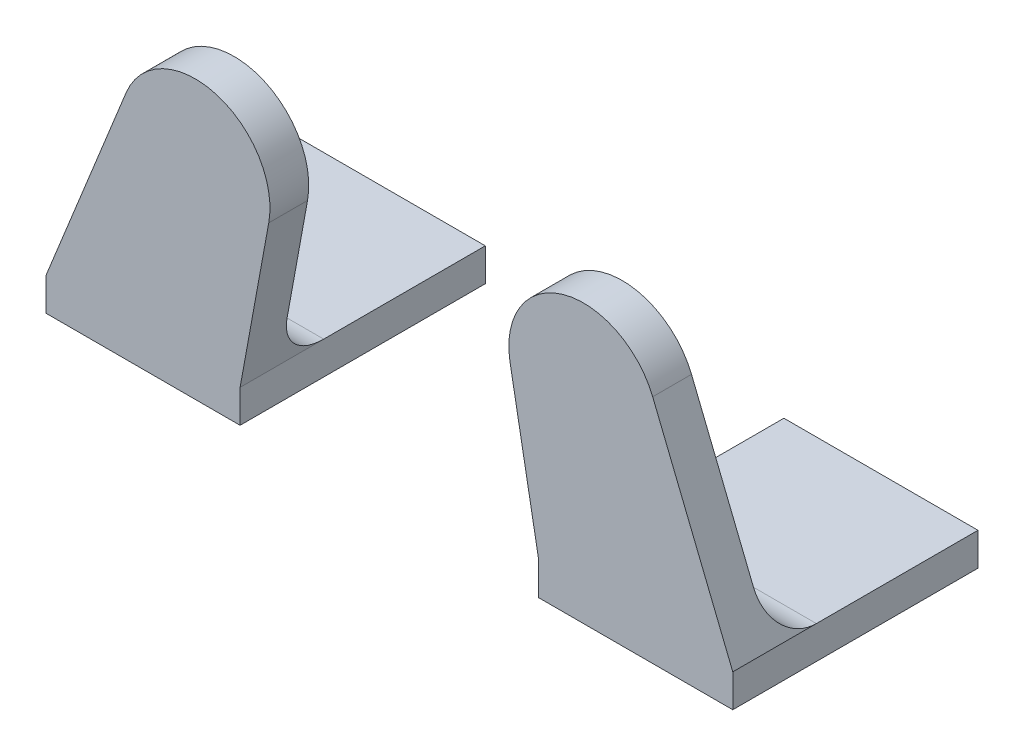
ISO-10303-21;
HEADER;
FILE_DESCRIPTION(('STEP AP214'),'2;1');
FILE_NAME('part.step','',(''),(''),'','','');
FILE_SCHEMA(('AUTOMOTIVE_DESIGN { 1 0 10303 214 1 1 1 1 }'));
ENDSEC;
DATA;
#1=APPLICATION_CONTEXT('core data for automotive mechanical design processes');
#2=APPLICATION_PROTOCOL_DEFINITION('international standard','automotive_design',2000,#1);
#3=PRODUCT_CONTEXT('',#1,'mechanical');
#4=PRODUCT('Part','Part','',(#3));
#5=PRODUCT_RELATED_PRODUCT_CATEGORY('part','',(#4));
#6=PRODUCT_DEFINITION_FORMATION('','',#4);
#7=PRODUCT_DEFINITION_CONTEXT('part definition',#1,'design');
#8=PRODUCT_DEFINITION('design','',#6,#7);
#9=PRODUCT_DEFINITION_SHAPE('','',#8);
#10=(LENGTH_UNIT() NAMED_UNIT(*) SI_UNIT(.MILLI.,.METRE.));
#11=(NAMED_UNIT(*) PLANE_ANGLE_UNIT() SI_UNIT($,.RADIAN.));
#12=(NAMED_UNIT(*) SI_UNIT($,.STERADIAN.) SOLID_ANGLE_UNIT());
#13=UNCERTAINTY_MEASURE_WITH_UNIT(LENGTH_MEASURE(1.E-05),#10,'distance_accuracy_value','');
#14=(GEOMETRIC_REPRESENTATION_CONTEXT(3) GLOBAL_UNCERTAINTY_ASSIGNED_CONTEXT((#13)) GLOBAL_UNIT_ASSIGNED_CONTEXT((#10,
#11,#12)) REPRESENTATION_CONTEXT('',''));
#15=CARTESIAN_POINT('',(0.,0.,0.));
#16=DIRECTION('',(0.,0.,1.));
#17=DIRECTION('',(1.,0.,0.));
#18=AXIS2_PLACEMENT_3D('',#15,#16,#17);
#19=CARTESIAN_POINT('',(0.,-93.2998175726996,0.));
#20=DIRECTION('',(0.,-1.,0.));
#21=DIRECTION('',(0.,0.,-1.));
#22=AXIS2_PLACEMENT_3D('',#19,#20,#21);
#23=PLANE('',#22);
#24=DIRECTION('',(0.,0.,-1.));
#25=VECTOR('',#24,1.);
#26=CARTESIAN_POINT('',(23.0000603569878,-93.2998175726996,12.45));
#27=LINE('',#26,#25);
#28=CARTESIAN_POINT('',(23.0000603569878,-93.2998175726996,6.85000000000001));
#29=VERTEX_POINT('',#28);
#30=CARTESIAN_POINT('',(23.0000603569878,-93.2998175726996,-3.97499999999999));
#31=VERTEX_POINT('',#30);
#32=EDGE_CURVE('E124',#29,#31,#27,.T.);
#33=ORIENTED_EDGE('',*,*,#32,.T.);
#34=DIRECTION('',(1.,0.,0.));
#35=VECTOR('',#34,1.);
#36=CARTESIAN_POINT('',(23.0000603569878,-93.2998175726996,-3.97499999999999));
#37=LINE('',#36,#35);
#38=CARTESIAN_POINT('',(9.99982028537325,-93.2998175726996,-3.97499999999999));
#39=VERTEX_POINT('',#38);
#40=EDGE_CURVE('E131',#39,#31,#37,.T.);
#41=ORIENTED_EDGE('',*,*,#40,.F.);
#42=DIRECTION('',(0.,0.,1.));
#43=VECTOR('',#42,1.);
#44=CARTESIAN_POINT('',(9.99982028537324,-93.2998175726996,12.45));
#45=LINE('',#44,#43);
#46=CARTESIAN_POINT('',(9.99982028537324,-93.2998175726996,6.85));
#47=VERTEX_POINT('',#46);
#48=EDGE_CURVE('E180',#39,#47,#45,.T.);
#49=ORIENTED_EDGE('',*,*,#48,.T.);
#50=DIRECTION('',(-1.,0.,0.));
#51=VECTOR('',#50,1.);
#52=CARTESIAN_POINT('',(9.99982028537324,-93.2998175726996,6.85));
#53=LINE('',#52,#51);
#54=EDGE_CURVE('E139',#29,#47,#53,.T.);
#55=ORIENTED_EDGE('',*,*,#54,.F.);
#56=EDGE_LOOP('',(#33,#41,#49,#55));
#57=FACE_BOUND('',#56,.T.);
#58=ADVANCED_FACE('F46',(#57),#23,.F.);
#59=CARTESIAN_POINT('',(23.0000603569878,-95.4998175726996,12.45));
#60=DIRECTION('',(-1.,0.,0.));
#61=DIRECTION('',(0.,0.,-1.));
#62=AXIS2_PLACEMENT_3D('',#59,#60,#61);
#63=PLANE('',#62);
#64=CARTESIAN_POINT('',(23.0000603569878,-93.2998175726996,12.45));
#65=VERTEX_POINT('',#64);
#66=EDGE_CURVE('E184',#65,#29,#27,.T.);
#67=ORIENTED_EDGE('',*,*,#66,.F.);
#68=DIRECTION('',(0.,1.,0.));
#69=VECTOR('',#68,1.);
#70=CARTESIAN_POINT('',(23.0000603569878,-95.4998175726996,12.45));
#71=LINE('',#70,#69);
#72=CARTESIAN_POINT('',(23.0000603569878,-95.4998175726996,12.45));
#73=VERTEX_POINT('',#72);
#74=EDGE_CURVE('E128',#73,#65,#71,.T.);
#75=ORIENTED_EDGE('',*,*,#74,.F.);
#76=DIRECTION('',(0.,0.,-1.));
#77=VECTOR('',#76,1.);
#78=CARTESIAN_POINT('',(23.0000603569878,-95.4998175726996,12.45));
#79=LINE('',#78,#77);
#80=CARTESIAN_POINT('',(23.0000603569878,-95.4998175726996,-3.97499999999999));
#81=VERTEX_POINT('',#80);
#82=EDGE_CURVE('E127',#73,#81,#79,.T.);
#83=ORIENTED_EDGE('',*,*,#82,.T.);
#84=DIRECTION('',(0.,-1.,0.));
#85=VECTOR('',#84,1.);
#86=CARTESIAN_POINT('',(23.0000603569878,-93.2998175726996,-3.97499999999999));
#87=LINE('',#86,#85);
#88=EDGE_CURVE('E119',#31,#81,#87,.T.);
#89=ORIENTED_EDGE('',*,*,#88,.F.);
#90=ORIENTED_EDGE('',*,*,#32,.F.);
#91=EDGE_LOOP('',(#67,#75,#83,#89,#90));
#92=FACE_BOUND('',#91,.T.);
#93=ADVANCED_FACE('F122',(#92),#63,.F.);
#94=CARTESIAN_POINT('',(9.99982028537324,-95.4998175726996,12.45));
#95=DIRECTION('',(1.,0.,0.));
#96=DIRECTION('',(0.,0.,1.));
#97=AXIS2_PLACEMENT_3D('',#94,#95,#96);
#98=PLANE('',#97);
#99=DIRECTION('',(0.,0.,1.));
#100=VECTOR('',#99,1.);
#101=CARTESIAN_POINT('',(9.99982028537324,-95.4998175726996,12.45));
#102=LINE('',#101,#100);
#103=CARTESIAN_POINT('',(9.99982028537324,-95.4998175726996,-3.97499999999998));
#104=VERTEX_POINT('',#103);
#105=CARTESIAN_POINT('',(9.99982028537324,-95.4998175726996,12.45));
#106=VERTEX_POINT('',#105);
#107=EDGE_CURVE('E176',#104,#106,#102,.T.);
#108=ORIENTED_EDGE('',*,*,#107,.T.);
#109=DIRECTION('',(0.,1.,0.));
#110=VECTOR('',#109,1.);
#111=CARTESIAN_POINT('',(9.99982028537324,-95.4998175726996,12.45));
#112=LINE('',#111,#110);
#113=CARTESIAN_POINT('',(9.99982028537324,-93.2998175726996,12.45));
#114=VERTEX_POINT('',#113);
#115=EDGE_CURVE('E166',#106,#114,#112,.T.);
#116=ORIENTED_EDGE('',*,*,#115,.T.);
#117=DIRECTION('',(0.,0.,-1.));
#118=VECTOR('',#117,1.);
#119=CARTESIAN_POINT('',(9.99982028537324,-93.2998175726996,12.45));
#120=LINE('',#119,#118);
#121=EDGE_CURVE('E152',#114,#47,#120,.T.);
#122=ORIENTED_EDGE('',*,*,#121,.T.);
#123=ORIENTED_EDGE('',*,*,#48,.F.);
#124=DIRECTION('',(0.,-1.,0.));
#125=VECTOR('',#124,1.);
#126=CARTESIAN_POINT('',(9.99982028537325,-93.2998175726996,-3.97499999999999));
#127=LINE('',#126,#125);
#128=EDGE_CURVE('E133',#39,#104,#127,.T.);
#129=ORIENTED_EDGE('',*,*,#128,.T.);
#130=EDGE_LOOP('',(#108,#116,#122,#123,#129));
#131=FACE_BOUND('',#130,.T.);
#132=ADVANCED_FACE('F208',(#131),#98,.F.);
#133=CARTESIAN_POINT('',(0.,-95.4998175726996,0.));
#134=DIRECTION('',(0.,-1.,0.));
#135=DIRECTION('',(0.,0.,-1.));
#136=AXIS2_PLACEMENT_3D('',#133,#134,#135);
#137=PLANE('',#136);
#138=DIRECTION('',(1.,0.,0.));
#139=VECTOR('',#138,1.);
#140=CARTESIAN_POINT('',(23.0000603569878,-95.4998175726996,-3.97499999999999));
#141=LINE('',#140,#139);
#142=EDGE_CURVE('E85',#104,#81,#141,.T.);
#143=ORIENTED_EDGE('',*,*,#142,.T.);
#144=ORIENTED_EDGE('',*,*,#82,.F.);
#145=DIRECTION('',(1.,0.,0.));
#146=VECTOR('',#145,1.);
#147=CARTESIAN_POINT('',(23.0000603569878,-95.4998175726996,12.45));
#148=LINE('',#147,#146);
#149=EDGE_CURVE('E179',#106,#73,#148,.T.);
#150=ORIENTED_EDGE('',*,*,#149,.F.);
#151=ORIENTED_EDGE('',*,*,#107,.F.);
#152=EDGE_LOOP('',(#143,#144,#150,#151));
#153=FACE_BOUND('',#152,.T.);
#154=ADVANCED_FACE('F206',(#153),#137,.T.);
#155=CARTESIAN_POINT('',(23.0000603569878,-95.4998175726996,12.45));
#156=DIRECTION('',(0.,0.,-1.));
#157=DIRECTION('',(1.,0.,0.));
#158=AXIS2_PLACEMENT_3D('',#155,#156,#157);
#159=PLANE('',#158);
#160=ORIENTED_EDGE('',*,*,#115,.F.);
#161=ORIENTED_EDGE('',*,*,#149,.T.);
#162=ORIENTED_EDGE('',*,*,#74,.T.);
#163=DIRECTION('',(0.374703363464617,-0.927144751054712,0.));
#164=VECTOR('',#163,1.);
#165=CARTESIAN_POINT('',(23.0000603569878,-93.2998175726996,12.45));
#166=LINE('',#165,#164);
#167=CARTESIAN_POINT('',(17.6355329929038,-80.0261353150554,12.45));
#168=VERTEX_POINT('',#167);
#169=EDGE_CURVE('E153',#168,#65,#166,.T.);
#170=ORIENTED_EDGE('',*,*,#169,.F.);
#171=CARTESIAN_POINT('',(12.9998092376302,-81.8996521323785,12.45));
#172=DIRECTION('',(0.,0.,-1.));
#173=DIRECTION('',(-1.,0.,0.));
#174=AXIS2_PLACEMENT_3D('',#171,#172,#173);
#175=CIRCLE('',#174,5.);
#176=CARTESIAN_POINT('',(8.08122186795485,-82.7982612169476,12.45));
#177=VERTEX_POINT('',#176);
#178=EDGE_CURVE('E157',#177,#168,#175,.T.);
#179=ORIENTED_EDGE('',*,*,#178,.F.);
#180=DIRECTION('',(-0.179721816913822,0.98371747393507,0.));
#181=VECTOR('',#180,1.);
#182=CARTESIAN_POINT('',(9.99982028537324,-93.2998175726996,12.45));
#183=LINE('',#182,#181);
#184=EDGE_CURVE('E164',#114,#177,#183,.T.);
#185=ORIENTED_EDGE('',*,*,#184,.F.);
#186=EDGE_LOOP('',(#160,#161,#162,#170,#179,#185));
#187=FACE_BOUND('',#186,.T.);
#188=ADVANCED_FACE('F203',(#187),#159,.F.);
#189=CARTESIAN_POINT('',(9.99982028537324,-93.2998175726996,12.45));
#190=DIRECTION('',(0.98371747393507,0.179721816913822,0.));
#191=DIRECTION('',(0.179721816913822,-0.98371747393507,0.));
#192=AXIS2_PLACEMENT_3D('',#189,#190,#191);
#193=PLANE('',#192);
#194=ORIENTED_EDGE('',*,*,#121,.F.);
#195=ORIENTED_EDGE('',*,*,#184,.T.);
#196=DIRECTION('',(0.,0.,-1.));
#197=VECTOR('',#196,1.);
#198=CARTESIAN_POINT('',(8.08122186795485,-82.7982612169476,12.45));
#199=LINE('',#198,#197);
#200=CARTESIAN_POINT('',(8.08122186795485,-82.7982612169476,9.85));
#201=VERTEX_POINT('',#200);
#202=EDGE_CURVE('E150',#177,#201,#199,.T.);
#203=ORIENTED_EDGE('',*,*,#202,.T.);
#204=DIRECTION('',(-0.179721816913822,0.98371747393507,0.));
#205=VECTOR('',#204,1.);
#206=CARTESIAN_POINT('',(9.99982028537324,-93.2998175726996,9.85));
#207=LINE('',#206,#205);
#208=CARTESIAN_POINT('',(9.45173054921689,-90.2998175726996,9.85));
#209=VERTEX_POINT('',#208);
#210=EDGE_CURVE('E147',#209,#201,#207,.T.);
#211=ORIENTED_EDGE('',*,*,#210,.F.);
#212=CARTESIAN_POINT('',(9.45173054921689,-90.2998175726996,6.85));
#213=DIRECTION('',(-0.98371747393507,-0.179721816913822,0.));
#214=DIRECTION('',(0.179721816913822,-0.98371747393507,0.));
#215=AXIS2_PLACEMENT_3D('',#212,#213,#214);
#216=ELLIPSE('',#215,3.04965610501905,3.);
#217=EDGE_CURVE('E54',#47,#209,#216,.T.);
#218=ORIENTED_EDGE('',*,*,#217,.F.);
#219=EDGE_LOOP('',(#194,#195,#203,#211,#218));
#220=FACE_BOUND('',#219,.T.);
#221=ADVANCED_FACE('F148',(#220),#193,.F.);
#222=CARTESIAN_POINT('',(12.9998092376302,-81.8996521323785,12.45));
#223=DIRECTION('',(0.,0.,-1.));
#224=DIRECTION('',(1.,0.,0.));
#225=AXIS2_PLACEMENT_3D('',#222,#223,#224);
#226=CYLINDRICAL_SURFACE('',#225,5.);
#227=CARTESIAN_POINT('',(12.9998092376302,-81.8996521323785,9.85));
#228=DIRECTION('',(0.,0.,-1.));
#229=DIRECTION('',(-1.,0.,0.));
#230=AXIS2_PLACEMENT_3D('',#227,#228,#229);
#231=CIRCLE('',#230,5.);
#232=CARTESIAN_POINT('',(17.6355329929038,-80.0261353150554,9.85));
#233=VERTEX_POINT('',#232);
#234=EDGE_CURVE('E155',#201,#233,#231,.T.);
#235=ORIENTED_EDGE('',*,*,#234,.F.);
#236=ORIENTED_EDGE('',*,*,#202,.F.);
#237=ORIENTED_EDGE('',*,*,#178,.T.);
#238=DIRECTION('',(0.,0.,-1.));
#239=VECTOR('',#238,1.);
#240=CARTESIAN_POINT('',(17.6355329929038,-80.0261353150554,12.45));
#241=LINE('',#240,#239);
#242=EDGE_CURVE('E171',#168,#233,#241,.T.);
#243=ORIENTED_EDGE('',*,*,#242,.T.);
#244=EDGE_LOOP('',(#235,#236,#237,#243));
#245=FACE_BOUND('',#244,.T.);
#246=ADVANCED_FACE('F198',(#245),#226,.T.);
#247=CARTESIAN_POINT('',(23.0000603569878,-93.2998175726996,12.45));
#248=DIRECTION('',(-0.927144751054712,-0.374703363464617,0.));
#249=DIRECTION('',(-0.374703363464617,0.927144751054712,0.));
#250=AXIS2_PLACEMENT_3D('',#247,#248,#249);
#251=PLANE('',#250);
#252=DIRECTION('',(0.374703363464617,-0.927144751054712,0.));
#253=VECTOR('',#252,1.);
#254=CARTESIAN_POINT('',(23.0000603569878,-93.2998175726996,9.85));
#255=LINE('',#254,#253);
#256=CARTESIAN_POINT('',(21.7876174357341,-90.2998175726996,9.85));
#257=VERTEX_POINT('',#256);
#258=EDGE_CURVE('E192',#233,#257,#255,.T.);
#259=ORIENTED_EDGE('',*,*,#258,.F.);
#260=ORIENTED_EDGE('',*,*,#242,.F.);
#261=ORIENTED_EDGE('',*,*,#169,.T.);
#262=ORIENTED_EDGE('',*,*,#66,.T.);
#263=CARTESIAN_POINT('',(21.7876174357341,-90.2998175726996,6.85));
#264=DIRECTION('',(0.927144751054712,0.374703363464617,0.));
#265=DIRECTION('',(0.374703363464617,-0.927144751054712,0.));
#266=AXIS2_PLACEMENT_3D('',#263,#264,#265);
#267=ELLIPSE('',#266,3.23574069376678,3.);
#268=EDGE_CURVE('E12',#257,#29,#267,.T.);
#269=ORIENTED_EDGE('',*,*,#268,.F.);
#270=EDGE_LOOP('',(#259,#260,#261,#262,#269));
#271=FACE_BOUND('',#270,.T.);
#272=ADVANCED_FACE('F196',(#271),#251,.F.);
#273=CARTESIAN_POINT('',(12.9998092376302,-81.8996521323785,9.85));
#274=DIRECTION('',(0.,0.,1.));
#275=DIRECTION('',(-1.,0.,0.));
#276=AXIS2_PLACEMENT_3D('',#273,#274,#275);
#277=PLANE('',#276);
#278=CARTESIAN_POINT('',(12.9998092376302,-81.8996521323785,9.85));
#279=DIRECTION('',(0.,0.,1.));
#280=DIRECTION('',(1.,0.,0.));
#281=AXIS2_PLACEMENT_3D('',#278,#279,#280);
#282=CIRCLE('',#281,2.);
#283=CARTESIAN_POINT('',(14.9998092376302,-81.8996521323785,9.85));
#284=VERTEX_POINT('',#283);
#285=EDGE_CURVE('E167',#284,#284,#282,.T.);
#286=ORIENTED_EDGE('',*,*,#285,.T.);
#287=EDGE_LOOP('',(#286));
#288=FACE_BOUND('',#287,.T.);
#289=ORIENTED_EDGE('',*,*,#210,.T.);
#290=ORIENTED_EDGE('',*,*,#234,.T.);
#291=ORIENTED_EDGE('',*,*,#258,.T.);
#292=DIRECTION('',(-1.,0.,0.));
#293=VECTOR('',#292,1.);
#294=CARTESIAN_POINT('',(23.0000603569878,-90.2998175726996,9.85));
#295=LINE('',#294,#293);
#296=EDGE_CURVE('E67',#209,#257,#295,.F.);
#297=ORIENTED_EDGE('',*,*,#296,.F.);
#298=EDGE_LOOP('',(#289,#290,#291,#297));
#299=FACE_BOUND('',#298,.T.);
#300=ADVANCED_FACE('F194',(#288,#299),#277,.F.);
#301=CARTESIAN_POINT('',(12.9998092376302,-81.8996521323785,11.37));
#302=DIRECTION('',(0.,0.,-1.));
#303=DIRECTION('',(1.,0.,0.));
#304=AXIS2_PLACEMENT_3D('',#301,#302,#303);
#305=CYLINDRICAL_SURFACE('',#304,2.);
#306=CARTESIAN_POINT('',(12.9998092376302,-81.8996521323785,11.37));
#307=DIRECTION('',(0.,0.,1.));
#308=DIRECTION('',(1.,0.,0.));
#309=AXIS2_PLACEMENT_3D('',#306,#307,#308);
#310=CIRCLE('',#309,2.);
#311=CARTESIAN_POINT('',(14.9998092376302,-81.8996521323785,11.37));
#312=VERTEX_POINT('',#311);
#313=EDGE_CURVE('E170',#312,#312,#310,.T.);
#314=ORIENTED_EDGE('',*,*,#313,.T.);
#315=EDGE_LOOP('',(#314));
#316=FACE_BOUND('',#315,.T.);
#317=ORIENTED_EDGE('',*,*,#285,.F.);
#318=EDGE_LOOP('',(#317));
#319=FACE_BOUND('',#318,.T.);
#320=ADVANCED_FACE('F276',(#316,#319),#305,.F.);
#321=CARTESIAN_POINT('',(12.9998092376302,-81.8996521323785,11.37));
#322=DIRECTION('',(0.,0.,-1.));
#323=DIRECTION('',(1.,0.,0.));
#324=AXIS2_PLACEMENT_3D('',#321,#322,#323);
#325=PLANE('',#324);
#326=ORIENTED_EDGE('',*,*,#313,.F.);
#327=EDGE_LOOP('',(#326));
#328=FACE_BOUND('',#327,.T.);
#329=ADVANCED_FACE('F286',(#328),#325,.T.);
#330=CARTESIAN_POINT('',(23.0000603569878,-93.2998175726996,-3.97499999999999));
#331=DIRECTION('',(0.,0.,1.));
#332=DIRECTION('',(-1.,0.,0.));
#333=AXIS2_PLACEMENT_3D('',#330,#331,#332);
#334=PLANE('',#333);
#335=ORIENTED_EDGE('',*,*,#142,.F.);
#336=ORIENTED_EDGE('',*,*,#128,.F.);
#337=ORIENTED_EDGE('',*,*,#40,.T.);
#338=ORIENTED_EDGE('',*,*,#88,.T.);
#339=EDGE_LOOP('',(#335,#336,#337,#338));
#340=FACE_BOUND('',#339,.T.);
#341=ADVANCED_FACE('F132',(#340),#334,.F.);
#342=CARTESIAN_POINT('',(0.,-90.2998175726996,6.85));
#343=DIRECTION('',(1.,0.,0.));
#344=DIRECTION('',(0.,0.,1.));
#345=AXIS2_PLACEMENT_3D('',#342,#343,#344);
#346=CYLINDRICAL_SURFACE('',#345,3.);
#347=ORIENTED_EDGE('',*,*,#268,.T.);
#348=ORIENTED_EDGE('',*,*,#54,.T.);
#349=ORIENTED_EDGE('',*,*,#217,.T.);
#350=ORIENTED_EDGE('',*,*,#296,.T.);
#351=EDGE_LOOP('',(#347,#348,#349,#350));
#352=FACE_BOUND('',#351,.T.);
#353=ADVANCED_FACE('F48',(#352),#346,.F.);
#354=CLOSED_SHELL('',(#58,#93,#132,#154,#188,#221,#246,#272,#300,#320,#329,#341,#353));
#355=MANIFOLD_SOLID_BREP('B2_NOT_SHOWN',#354);
#356=CARTESIAN_POINT('',(0.,-93.2998175726996,0.));
#357=DIRECTION('',(0.,-1.,0.));
#358=DIRECTION('',(0.,0.,-1.));
#359=AXIS2_PLACEMENT_3D('',#356,#357,#358);
#360=PLANE('',#359);
#361=DIRECTION('',(0.,0.,-1.));
#362=VECTOR('',#361,1.);
#363=CARTESIAN_POINT('',(-23.0000603569878,-93.2998175726996,12.45));
#364=LINE('',#363,#362);
#365=CARTESIAN_POINT('',(-23.0000603569878,-93.2998175726996,6.85000000000001));
#366=VERTEX_POINT('',#365);
#367=CARTESIAN_POINT('',(-23.0000603569878,-93.2998175726996,-3.97499999999999));
#368=VERTEX_POINT('',#367);
#369=EDGE_CURVE('E393',#366,#368,#364,.T.);
#370=ORIENTED_EDGE('',*,*,#369,.F.);
#371=DIRECTION('',(1.,0.,0.));
#372=VECTOR('',#371,1.);
#373=CARTESIAN_POINT('',(-9.99982028537324,-93.2998175726996,6.85));
#374=LINE('',#373,#372);
#375=CARTESIAN_POINT('',(-9.99982028537324,-93.2998175726996,6.85));
#376=VERTEX_POINT('',#375);
#377=EDGE_CURVE('E457',#366,#376,#374,.T.);
#378=ORIENTED_EDGE('',*,*,#377,.T.);
#379=DIRECTION('',(0.,0.,1.));
#380=VECTOR('',#379,1.);
#381=CARTESIAN_POINT('',(-9.99982028537324,-93.2998175726996,12.45));
#382=LINE('',#381,#380);
#383=CARTESIAN_POINT('',(-9.99982028537325,-93.2998175726996,-3.97499999999999));
#384=VERTEX_POINT('',#383);
#385=EDGE_CURVE('E410',#384,#376,#382,.T.);
#386=ORIENTED_EDGE('',*,*,#385,.F.);
#387=DIRECTION('',(-1.,0.,0.));
#388=VECTOR('',#387,1.);
#389=CARTESIAN_POINT('',(-23.0000603569878,-93.2998175726996,-3.97499999999999));
#390=LINE('',#389,#388);
#391=EDGE_CURVE('E402',#384,#368,#390,.T.);
#392=ORIENTED_EDGE('',*,*,#391,.T.);
#393=EDGE_LOOP('',(#370,#378,#386,#392));
#394=FACE_BOUND('',#393,.T.);
#395=ADVANCED_FACE('F325',(#394),#360,.F.);
#396=CARTESIAN_POINT('',(-23.0000603569878,-95.4998175726996,12.45));
#397=DIRECTION('',(1.,0.,0.));
#398=DIRECTION('',(0.,0.,-1.));
#399=AXIS2_PLACEMENT_3D('',#396,#397,#398);
#400=PLANE('',#399);
#401=CARTESIAN_POINT('',(-23.0000603569878,-93.2998175726996,12.45));
#402=VERTEX_POINT('',#401);
#403=EDGE_CURVE('E340',#402,#366,#364,.T.);
#404=ORIENTED_EDGE('',*,*,#403,.T.);
#405=ORIENTED_EDGE('',*,*,#369,.T.);
#406=DIRECTION('',(0.,-1.,0.));
#407=VECTOR('',#406,1.);
#408=CARTESIAN_POINT('',(-23.0000603569878,-93.2998175726996,-3.97499999999999));
#409=LINE('',#408,#407);
#410=CARTESIAN_POINT('',(-23.0000603569878,-95.4998175726996,-3.97499999999999));
#411=VERTEX_POINT('',#410);
#412=EDGE_CURVE('E397',#368,#411,#409,.T.);
#413=ORIENTED_EDGE('',*,*,#412,.T.);
#414=DIRECTION('',(0.,0.,-1.));
#415=VECTOR('',#414,1.);
#416=CARTESIAN_POINT('',(-23.0000603569878,-95.4998175726996,12.45));
#417=LINE('',#416,#415);
#418=CARTESIAN_POINT('',(-23.0000603569878,-95.4998175726996,12.45));
#419=VERTEX_POINT('',#418);
#420=EDGE_CURVE('E417',#419,#411,#417,.T.);
#421=ORIENTED_EDGE('',*,*,#420,.F.);
#422=DIRECTION('',(0.,1.,0.));
#423=VECTOR('',#422,1.);
#424=CARTESIAN_POINT('',(-23.0000603569878,-95.4998175726996,12.45));
#425=LINE('',#424,#423);
#426=EDGE_CURVE('E406',#419,#402,#425,.T.);
#427=ORIENTED_EDGE('',*,*,#426,.T.);
#428=EDGE_LOOP('',(#404,#405,#413,#421,#427));
#429=FACE_BOUND('',#428,.T.);
#430=ADVANCED_FACE('F395',(#429),#400,.F.);
#431=CARTESIAN_POINT('',(-9.99982028537324,-95.4998175726996,12.45));
#432=DIRECTION('',(-1.,0.,0.));
#433=DIRECTION('',(0.,0.,1.));
#434=AXIS2_PLACEMENT_3D('',#431,#432,#433);
#435=PLANE('',#434);
#436=DIRECTION('',(0.,0.,1.));
#437=VECTOR('',#436,1.);
#438=CARTESIAN_POINT('',(-9.99982028537324,-95.4998175726996,12.45));
#439=LINE('',#438,#437);
#440=CARTESIAN_POINT('',(-9.99982028537324,-95.4998175726996,-3.97499999999998));
#441=VERTEX_POINT('',#440);
#442=CARTESIAN_POINT('',(-9.99982028537324,-95.4998175726996,12.45));
#443=VERTEX_POINT('',#442);
#444=EDGE_CURVE('E414',#441,#443,#439,.T.);
#445=ORIENTED_EDGE('',*,*,#444,.F.);
#446=DIRECTION('',(0.,-1.,0.));
#447=VECTOR('',#446,1.);
#448=CARTESIAN_POINT('',(-9.99982028537325,-93.2998175726996,-3.97499999999999));
#449=LINE('',#448,#447);
#450=EDGE_CURVE('E365',#384,#441,#449,.T.);
#451=ORIENTED_EDGE('',*,*,#450,.F.);
#452=ORIENTED_EDGE('',*,*,#385,.T.);
#453=DIRECTION('',(0.,0.,-1.));
#454=VECTOR('',#453,1.);
#455=CARTESIAN_POINT('',(-9.99982028537324,-93.2998175726996,12.45));
#456=LINE('',#455,#454);
#457=CARTESIAN_POINT('',(-9.99982028537324,-93.2998175726996,12.45));
#458=VERTEX_POINT('',#457);
#459=EDGE_CURVE('E357',#458,#376,#456,.T.);
#460=ORIENTED_EDGE('',*,*,#459,.F.);
#461=DIRECTION('',(0.,1.,0.));
#462=VECTOR('',#461,1.);
#463=CARTESIAN_POINT('',(-9.99982028537324,-95.4998175726996,12.45));
#464=LINE('',#463,#462);
#465=EDGE_CURVE('E419',#443,#458,#464,.T.);
#466=ORIENTED_EDGE('',*,*,#465,.F.);
#467=EDGE_LOOP('',(#445,#451,#452,#460,#466));
#468=FACE_BOUND('',#467,.T.);
#469=ADVANCED_FACE('F483',(#468),#435,.F.);
#470=CARTESIAN_POINT('',(0.,-95.4998175726996,0.));
#471=DIRECTION('',(0.,-1.,0.));
#472=DIRECTION('',(0.,0.,-1.));
#473=AXIS2_PLACEMENT_3D('',#470,#471,#472);
#474=PLANE('',#473);
#475=DIRECTION('',(-1.,0.,0.));
#476=VECTOR('',#475,1.);
#477=CARTESIAN_POINT('',(-23.0000603569878,-95.4998175726996,-3.97499999999999));
#478=LINE('',#477,#476);
#479=EDGE_CURVE('E405',#441,#411,#478,.T.);
#480=ORIENTED_EDGE('',*,*,#479,.F.);
#481=ORIENTED_EDGE('',*,*,#444,.T.);
#482=DIRECTION('',(-1.,0.,0.));
#483=VECTOR('',#482,1.);
#484=CARTESIAN_POINT('',(-23.0000603569878,-95.4998175726996,12.45));
#485=LINE('',#484,#483);
#486=EDGE_CURVE('E416',#443,#419,#485,.T.);
#487=ORIENTED_EDGE('',*,*,#486,.T.);
#488=ORIENTED_EDGE('',*,*,#420,.T.);
#489=EDGE_LOOP('',(#480,#481,#487,#488));
#490=FACE_BOUND('',#489,.T.);
#491=ADVANCED_FACE('F488',(#490),#474,.T.);
#492=CARTESIAN_POINT('',(-23.0000603569878,-95.4998175726996,12.45));
#493=DIRECTION('',(0.,0.,-1.));
#494=DIRECTION('',(-1.,0.,0.));
#495=AXIS2_PLACEMENT_3D('',#492,#493,#494);
#496=PLANE('',#495);
#497=ORIENTED_EDGE('',*,*,#465,.T.);
#498=DIRECTION('',(0.179721816913822,0.98371747393507,0.));
#499=VECTOR('',#498,1.);
#500=CARTESIAN_POINT('',(-9.99982028537324,-93.2998175726996,12.45));
#501=LINE('',#500,#499);
#502=CARTESIAN_POINT('',(-8.08122186795485,-82.7982612169476,12.45));
#503=VERTEX_POINT('',#502);
#504=EDGE_CURVE('E428',#458,#503,#501,.T.);
#505=ORIENTED_EDGE('',*,*,#504,.T.);
#506=CARTESIAN_POINT('',(-12.9998092376302,-81.8996521323785,12.45));
#507=DIRECTION('',(0.,0.,1.));
#508=DIRECTION('',(1.,0.,0.));
#509=AXIS2_PLACEMENT_3D('',#506,#507,#508);
#510=CIRCLE('',#509,5.);
#511=CARTESIAN_POINT('',(-17.6355329929038,-80.0261353150554,12.45));
#512=VERTEX_POINT('',#511);
#513=EDGE_CURVE('E449',#503,#512,#510,.T.);
#514=ORIENTED_EDGE('',*,*,#513,.T.);
#515=DIRECTION('',(-0.374703363464617,-0.927144751054712,0.));
#516=VECTOR('',#515,1.);
#517=CARTESIAN_POINT('',(-23.0000603569878,-93.2998175726996,12.45));
#518=LINE('',#517,#516);
#519=EDGE_CURVE('E446',#512,#402,#518,.T.);
#520=ORIENTED_EDGE('',*,*,#519,.T.);
#521=ORIENTED_EDGE('',*,*,#426,.F.);
#522=ORIENTED_EDGE('',*,*,#486,.F.);
#523=EDGE_LOOP('',(#497,#505,#514,#520,#521,#522));
#524=FACE_BOUND('',#523,.T.);
#525=ADVANCED_FACE('F491',(#524),#496,.F.);
#526=CARTESIAN_POINT('',(-9.99982028537324,-93.2998175726996,12.45));
#527=DIRECTION('',(-0.98371747393507,0.179721816913822,0.));
#528=DIRECTION('',(-0.179721816913822,-0.98371747393507,0.));
#529=AXIS2_PLACEMENT_3D('',#526,#527,#528);
#530=PLANE('',#529);
#531=ORIENTED_EDGE('',*,*,#459,.T.);
#532=CARTESIAN_POINT('',(-9.45173054921689,-90.2998175726996,6.85));
#533=DIRECTION('',(-0.98371747393507,0.179721816913822,0.));
#534=DIRECTION('',(-0.179721816913822,-0.98371747393507,0.));
#535=AXIS2_PLACEMENT_3D('',#532,#533,#534);
#536=ELLIPSE('',#535,3.04965610501905,3.);
#537=CARTESIAN_POINT('',(-9.45173054921689,-90.2998175726996,9.85));
#538=VERTEX_POINT('',#537);
#539=EDGE_CURVE('E333',#376,#538,#536,.T.);
#540=ORIENTED_EDGE('',*,*,#539,.T.);
#541=DIRECTION('',(0.179721816913822,0.98371747393507,0.));
#542=VECTOR('',#541,1.);
#543=CARTESIAN_POINT('',(-9.99982028537324,-93.2998175726996,9.85));
#544=LINE('',#543,#542);
#545=CARTESIAN_POINT('',(-8.08122186795485,-82.7982612169476,9.85));
#546=VERTEX_POINT('',#545);
#547=EDGE_CURVE('E433',#538,#546,#544,.T.);
#548=ORIENTED_EDGE('',*,*,#547,.T.);
#549=DIRECTION('',(0.,0.,-1.));
#550=VECTOR('',#549,1.);
#551=CARTESIAN_POINT('',(-8.08122186795485,-82.7982612169476,12.45));
#552=LINE('',#551,#550);
#553=EDGE_CURVE('E434',#503,#546,#552,.T.);
#554=ORIENTED_EDGE('',*,*,#553,.F.);
#555=ORIENTED_EDGE('',*,*,#504,.F.);
#556=EDGE_LOOP('',(#531,#540,#548,#554,#555));
#557=FACE_BOUND('',#556,.T.);
#558=ADVANCED_FACE('F509',(#557),#530,.F.);
#559=CARTESIAN_POINT('',(-12.9998092376302,-81.8996521323785,12.45));
#560=DIRECTION('',(0.,0.,-1.));
#561=DIRECTION('',(-1.,0.,0.));
#562=AXIS2_PLACEMENT_3D('',#559,#560,#561);
#563=CYLINDRICAL_SURFACE('',#562,5.);
#564=CARTESIAN_POINT('',(-12.9998092376302,-81.8996521323785,9.85));
#565=DIRECTION('',(0.,0.,1.));
#566=DIRECTION('',(1.,0.,0.));
#567=AXIS2_PLACEMENT_3D('',#564,#565,#566);
#568=CIRCLE('',#567,5.);
#569=CARTESIAN_POINT('',(-17.6355329929038,-80.0261353150554,9.85));
#570=VERTEX_POINT('',#569);
#571=EDGE_CURVE('E432',#546,#570,#568,.T.);
#572=ORIENTED_EDGE('',*,*,#571,.T.);
#573=DIRECTION('',(0.,0.,-1.));
#574=VECTOR('',#573,1.);
#575=CARTESIAN_POINT('',(-17.6355329929038,-80.0261353150554,12.45));
#576=LINE('',#575,#574);
#577=EDGE_CURVE('E438',#512,#570,#576,.T.);
#578=ORIENTED_EDGE('',*,*,#577,.F.);
#579=ORIENTED_EDGE('',*,*,#513,.F.);
#580=ORIENTED_EDGE('',*,*,#553,.T.);
#581=EDGE_LOOP('',(#572,#578,#579,#580));
#582=FACE_BOUND('',#581,.T.);
#583=ADVANCED_FACE('F506',(#582),#563,.T.);
#584=CARTESIAN_POINT('',(-23.0000603569878,-93.2998175726996,12.45));
#585=DIRECTION('',(0.927144751054712,-0.374703363464617,0.));
#586=DIRECTION('',(0.374703363464617,0.927144751054712,0.));
#587=AXIS2_PLACEMENT_3D('',#584,#585,#586);
#588=PLANE('',#587);
#589=DIRECTION('',(-0.374703363464617,-0.927144751054712,0.));
#590=VECTOR('',#589,1.);
#591=CARTESIAN_POINT('',(-23.0000603569878,-93.2998175726996,9.85));
#592=LINE('',#591,#590);
#593=CARTESIAN_POINT('',(-21.7876174357341,-90.2998175726996,9.85));
#594=VERTEX_POINT('',#593);
#595=EDGE_CURVE('E437',#570,#594,#592,.T.);
#596=ORIENTED_EDGE('',*,*,#595,.T.);
#597=CARTESIAN_POINT('',(-21.7876174357341,-90.2998175726996,6.85));
#598=DIRECTION('',(0.927144751054712,-0.374703363464617,0.));
#599=DIRECTION('',(-0.374703363464617,-0.927144751054712,0.));
#600=AXIS2_PLACEMENT_3D('',#597,#598,#599);
#601=ELLIPSE('',#600,3.23574069376678,3.);
#602=EDGE_CURVE('E44',#594,#366,#601,.T.);
#603=ORIENTED_EDGE('',*,*,#602,.T.);
#604=ORIENTED_EDGE('',*,*,#403,.F.);
#605=ORIENTED_EDGE('',*,*,#519,.F.);
#606=ORIENTED_EDGE('',*,*,#577,.T.);
#607=EDGE_LOOP('',(#596,#603,#604,#605,#606));
#608=FACE_BOUND('',#607,.T.);
#609=ADVANCED_FACE('F470',(#608),#588,.F.);
#610=CARTESIAN_POINT('',(-12.9998092376302,-81.8996521323785,9.85));
#611=DIRECTION('',(0.,0.,1.));
#612=DIRECTION('',(1.,0.,0.));
#613=AXIS2_PLACEMENT_3D('',#610,#611,#612);
#614=PLANE('',#613);
#615=CARTESIAN_POINT('',(-12.9998092376302,-81.8996521323785,9.85));
#616=DIRECTION('',(0.,0.,-1.));
#617=DIRECTION('',(-1.,0.,0.));
#618=AXIS2_PLACEMENT_3D('',#615,#616,#617);
#619=CIRCLE('',#618,2.);
#620=CARTESIAN_POINT('',(-14.9998092376302,-81.8996521323785,9.85));
#621=VERTEX_POINT('',#620);
#622=EDGE_CURVE('E441',#621,#621,#619,.T.);
#623=ORIENTED_EDGE('',*,*,#622,.F.);
#624=EDGE_LOOP('',(#623));
#625=FACE_BOUND('',#624,.T.);
#626=ORIENTED_EDGE('',*,*,#547,.F.);
#627=DIRECTION('',(1.,0.,0.));
#628=VECTOR('',#627,1.);
#629=CARTESIAN_POINT('',(-23.0000603569878,-90.2998175726996,9.85));
#630=LINE('',#629,#628);
#631=EDGE_CURVE('E458',#538,#594,#630,.F.);
#632=ORIENTED_EDGE('',*,*,#631,.T.);
#633=ORIENTED_EDGE('',*,*,#595,.F.);
#634=ORIENTED_EDGE('',*,*,#571,.F.);
#635=EDGE_LOOP('',(#626,#632,#633,#634));
#636=FACE_BOUND('',#635,.T.);
#637=ADVANCED_FACE('F465',(#625,#636),#614,.F.);
#638=CARTESIAN_POINT('',(-12.9998092376302,-81.8996521323785,11.37));
#639=DIRECTION('',(0.,0.,-1.));
#640=DIRECTION('',(-1.,0.,0.));
#641=AXIS2_PLACEMENT_3D('',#638,#639,#640);
#642=CYLINDRICAL_SURFACE('',#641,2.);
#643=CARTESIAN_POINT('',(-12.9998092376302,-81.8996521323785,11.37));
#644=DIRECTION('',(0.,0.,-1.));
#645=DIRECTION('',(-1.,0.,0.));
#646=AXIS2_PLACEMENT_3D('',#643,#644,#645);
#647=CIRCLE('',#646,2.);
#648=CARTESIAN_POINT('',(-14.9998092376302,-81.8996521323785,11.37));
#649=VERTEX_POINT('',#648);
#650=EDGE_CURVE('E454',#649,#649,#647,.T.);
#651=ORIENTED_EDGE('',*,*,#650,.F.);
#652=EDGE_LOOP('',(#651));
#653=FACE_BOUND('',#652,.T.);
#654=ORIENTED_EDGE('',*,*,#622,.T.);
#655=EDGE_LOOP('',(#654));
#656=FACE_BOUND('',#655,.T.);
#657=ADVANCED_FACE('F496',(#653,#656),#642,.F.);
#658=CARTESIAN_POINT('',(-12.9998092376302,-81.8996521323785,11.37));
#659=DIRECTION('',(0.,0.,-1.));
#660=DIRECTION('',(-1.,0.,0.));
#661=AXIS2_PLACEMENT_3D('',#658,#659,#660);
#662=PLANE('',#661);
#663=ORIENTED_EDGE('',*,*,#650,.T.);
#664=EDGE_LOOP('',(#663));
#665=FACE_BOUND('',#664,.T.);
#666=ADVANCED_FACE('F477',(#665),#662,.T.);
#667=CARTESIAN_POINT('',(-23.0000603569878,-93.2998175726996,-3.97499999999999));
#668=DIRECTION('',(0.,0.,1.));
#669=DIRECTION('',(1.,0.,0.));
#670=AXIS2_PLACEMENT_3D('',#667,#668,#669);
#671=PLANE('',#670);
#672=ORIENTED_EDGE('',*,*,#479,.T.);
#673=ORIENTED_EDGE('',*,*,#412,.F.);
#674=ORIENTED_EDGE('',*,*,#391,.F.);
#675=ORIENTED_EDGE('',*,*,#450,.T.);
#676=EDGE_LOOP('',(#672,#673,#674,#675));
#677=FACE_BOUND('',#676,.T.);
#678=ADVANCED_FACE('F404',(#677),#671,.F.);
#679=CARTESIAN_POINT('',(0.,-90.2998175726996,6.85));
#680=DIRECTION('',(-1.,0.,0.));
#681=DIRECTION('',(0.,0.,1.));
#682=AXIS2_PLACEMENT_3D('',#679,#680,#681);
#683=CYLINDRICAL_SURFACE('',#682,3.);
#684=ORIENTED_EDGE('',*,*,#602,.F.);
#685=ORIENTED_EDGE('',*,*,#631,.F.);
#686=ORIENTED_EDGE('',*,*,#539,.F.);
#687=ORIENTED_EDGE('',*,*,#377,.F.);
#688=EDGE_LOOP('',(#684,#685,#686,#687));
#689=FACE_BOUND('',#688,.T.);
#690=ADVANCED_FACE('F327',(#689),#683,.F.);
#691=CLOSED_SHELL('',(#395,#430,#469,#491,#525,#558,#583,#609,#637,#657,#666,#678,#690));
#692=MANIFOLD_SOLID_BREP('B6',#691);
#693=ADVANCED_BREP_SHAPE_REPRESENTATION('',(#18,#355,#692),#14);
#694=SHAPE_DEFINITION_REPRESENTATION(#9,#693);
ENDSEC;
END-ISO-10303-21;
